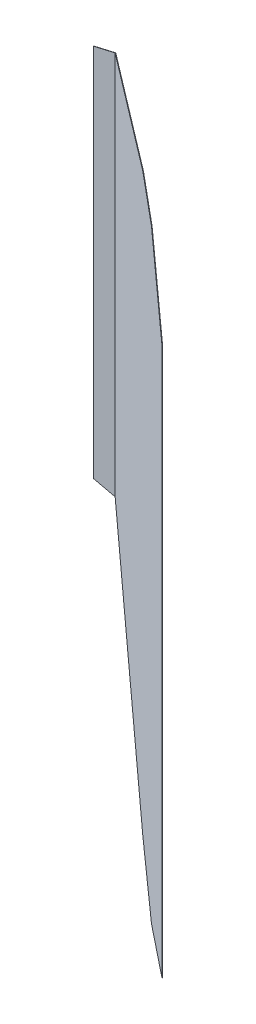
ISO-10303-21;
HEADER;
FILE_DESCRIPTION(('STEP AP214'),'2;1');
FILE_NAME('part.step','',(''),(''),'','','');
FILE_SCHEMA(('AUTOMOTIVE_DESIGN { 1 0 10303 214 1 1 1 1 }'));
ENDSEC;
DATA;
#1=APPLICATION_CONTEXT('core data for automotive mechanical design processes');
#2=APPLICATION_PROTOCOL_DEFINITION('international standard','automotive_design',2000,#1);
#3=PRODUCT_CONTEXT('',#1,'mechanical');
#4=PRODUCT('Part','Part','',(#3));
#5=PRODUCT_RELATED_PRODUCT_CATEGORY('part','',(#4));
#6=PRODUCT_DEFINITION_FORMATION('','',#4);
#7=PRODUCT_DEFINITION_CONTEXT('part definition',#1,'design');
#8=PRODUCT_DEFINITION('design','',#6,#7);
#9=PRODUCT_DEFINITION_SHAPE('','',#8);
#10=(LENGTH_UNIT() NAMED_UNIT(*) SI_UNIT(.MILLI.,.METRE.));
#11=(NAMED_UNIT(*) PLANE_ANGLE_UNIT() SI_UNIT($,.RADIAN.));
#12=(NAMED_UNIT(*) SI_UNIT($,.STERADIAN.) SOLID_ANGLE_UNIT());
#13=UNCERTAINTY_MEASURE_WITH_UNIT(LENGTH_MEASURE(1.E-05),#10,'distance_accuracy_value','');
#14=(GEOMETRIC_REPRESENTATION_CONTEXT(3) GLOBAL_UNCERTAINTY_ASSIGNED_CONTEXT((#13)) GLOBAL_UNIT_ASSIGNED_CONTEXT((#10,
#11,#12)) REPRESENTATION_CONTEXT('',''));
#15=CARTESIAN_POINT('',(0.,0.,0.));
#16=DIRECTION('',(0.,0.,1.));
#17=DIRECTION('',(1.,0.,0.));
#18=AXIS2_PLACEMENT_3D('',#15,#16,#17);
#19=CARTESIAN_POINT('',(961.046281695282,-400.,470.048059203297));
#20=DIRECTION('',(0.656059028990508,0.,-0.754709580222771));
#21=DIRECTION('',(-0.754709580222771,0.,-0.656059028990508));
#22=AXIS2_PLACEMENT_3D('',#19,#20,#21);
#23=PLANE('',#22);
#24=DIRECTION('',(0.,1.,0.));
#25=VECTOR('',#24,1.);
#26=CARTESIAN_POINT('',(543.39,-400.,106.98499255995));
#27=LINE('',#26,#25);
#28=CARTESIAN_POINT('',(543.39,-223.693412105865,106.98499255995));
#29=VERTEX_POINT('',#28);
#30=CARTESIAN_POINT('',(543.39,223.693412105865,106.98499255995));
#31=VERTEX_POINT('',#30);
#32=EDGE_CURVE('E193',#29,#31,#27,.T.);
#33=ORIENTED_EDGE('',*,*,#32,.T.);
#34=DIRECTION('',(0.714377011708552,0.322531231414625,0.620998462079033));
#35=VECTOR('',#34,1.);
#36=CARTESIAN_POINT('',(773.89449293756,327.762967446044,307.359491277625));
#37=LINE('',#36,#35);
#38=CARTESIAN_POINT('',(790.210009542547,335.12919504789,321.54235348296));
#39=VERTEX_POINT('',#38);
#40=EDGE_CURVE('E65',#31,#39,#37,.T.);
#41=ORIENTED_EDGE('',*,*,#40,.T.);
#42=DIRECTION('',(0.744983290834813,0.160027600780985,0.647604094617394));
#43=VECTOR('',#42,1.);
#44=CARTESIAN_POINT('',(869.030813607693,352.060452864477,390.060233120804));
#45=LINE('',#44,#43);
#46=CARTESIAN_POINT('',(867.278022463826,351.683941115994,388.536555025278));
#47=VERTEX_POINT('',#46);
#48=EDGE_CURVE('E166',#39,#47,#45,.T.);
#49=ORIENTED_EDGE('',*,*,#48,.T.);
#50=DIRECTION('',(0.729499819806553,-0.256302053123606,0.634144518597166));
#51=VECTOR('',#50,1.);
#52=CARTESIAN_POINT('',(1095.43065165295,271.524925720722,586.866609777288));
#53=LINE('',#52,#51);
#54=CARTESIAN_POINT('',(961.046281695282,318.739454076611,470.048059203297));
#55=VERTEX_POINT('',#54);
#56=EDGE_CURVE('E159',#47,#55,#53,.T.);
#57=ORIENTED_EDGE('',*,*,#56,.T.);
#58=DIRECTION('',(0.,1.,0.));
#59=VECTOR('',#58,1.);
#60=CARTESIAN_POINT('',(961.046281695282,-400.,470.048059203297));
#61=LINE('',#60,#59);
#62=CARTESIAN_POINT('',(961.046281695282,-318.739454076611,470.048059203297));
#63=VERTEX_POINT('',#62);
#64=EDGE_CURVE('E196',#63,#55,#61,.T.);
#65=ORIENTED_EDGE('',*,*,#64,.F.);
#66=DIRECTION('',(-0.729499819806553,-0.256302053123606,-0.634144518597166));
#67=VECTOR('',#66,1.);
#68=CARTESIAN_POINT('',(945.852810397173,-324.077519669023,456.84057610246));
#69=LINE('',#68,#67);
#70=CARTESIAN_POINT('',(867.278022463826,-351.683941115994,388.536555025278));
#71=VERTEX_POINT('',#70);
#72=EDGE_CURVE('E184',#63,#71,#69,.T.);
#73=ORIENTED_EDGE('',*,*,#72,.T.);
#74=DIRECTION('',(-0.744983290834813,0.160027600780985,-0.647604094617394));
#75=VECTOR('',#74,1.);
#76=CARTESIAN_POINT('',(964.405124531068,-372.547519273852,472.967856734855));
#77=LINE('',#76,#75);
#78=CARTESIAN_POINT('',(790.210009542546,-335.12919504789,321.54235348296));
#79=VERTEX_POINT('',#78);
#80=EDGE_CURVE('E190',#71,#79,#77,.T.);
#81=ORIENTED_EDGE('',*,*,#80,.T.);
#82=DIRECTION('',(-0.714377011708552,0.322531231414625,-0.620998462079033));
#83=VECTOR('',#82,1.);
#84=CARTESIAN_POINT('',(958.221610762087,-410.984083636311,467.592610222376));
#85=LINE('',#84,#83);
#86=EDGE_CURVE('E176',#79,#29,#85,.T.);
#87=ORIENTED_EDGE('',*,*,#86,.T.);
#88=EDGE_LOOP('',(#33,#41,#49,#57,#65,#73,#81,#87));
#89=FACE_BOUND('',#88,.T.);
#90=ADVANCED_FACE('F50',(#89),#23,.T.);
#91=CARTESIAN_POINT('',(960.718252180786,-400.,470.425413993408));
#92=DIRECTION('',(0.656059028990509,0.,-0.754709580222771));
#93=DIRECTION('',(-0.754709580222771,0.,-0.656059028990509));
#94=AXIS2_PLACEMENT_3D('',#91,#92,#93);
#95=PLANE('',#94);
#96=DIRECTION('',(0.714377011708552,0.322531231414625,0.620998462079034));
#97=VECTOR('',#96,1.);
#98=CARTESIAN_POINT('',(773.561643532495,327.781710188962,307.732656200787));
#99=LINE('',#98,#97);
#100=CARTESIAN_POINT('',(543.203057660258,223.778029848509,107.48499255995));
#101=VERTEX_POINT('',#100);
#102=CARTESIAN_POINT('',(789.793595119899,335.110209353888,321.842876444591));
#103=VERTEX_POINT('',#102);
#104=EDGE_CURVE('E151',#101,#103,#99,.T.);
#105=ORIENTED_EDGE('',*,*,#104,.F.);
#106=DIRECTION('',(0.,1.,0.));
#107=VECTOR('',#106,1.);
#108=CARTESIAN_POINT('',(543.203057660258,-400.,107.48499255995));
#109=LINE('',#108,#107);
#110=CARTESIAN_POINT('',(543.203057660258,-223.778029848509,107.48499255995));
#111=VERTEX_POINT('',#110);
#112=EDGE_CURVE('E135',#111,#101,#109,.T.);
#113=ORIENTED_EDGE('',*,*,#112,.F.);
#114=DIRECTION('',(-0.714377011708552,0.322531231414625,-0.620998462079034));
#115=VECTOR('',#114,1.);
#116=CARTESIAN_POINT('',(957.888761357023,-411.00282637923,467.965775145538));
#117=LINE('',#116,#115);
#118=CARTESIAN_POINT('',(789.793595119899,-335.110209353888,321.842876444591));
#119=VERTEX_POINT('',#118);
#120=EDGE_CURVE('E173',#119,#111,#117,.T.);
#121=ORIENTED_EDGE('',*,*,#120,.F.);
#122=DIRECTION('',(-0.744983290834813,0.160027600780985,-0.647604094617394));
#123=VECTOR('',#122,1.);
#124=CARTESIAN_POINT('',(964.077095016572,-372.547519273852,473.345211524966));
#125=LINE('',#124,#123);
#126=CARTESIAN_POINT('',(866.94999294933,-351.683941115994,388.913909815389));
#127=VERTEX_POINT('',#126);
#128=EDGE_CURVE('E187',#127,#119,#125,.T.);
#129=ORIENTED_EDGE('',*,*,#128,.F.);
#130=DIRECTION('',(-0.729499819806553,-0.256302053123606,-0.634144518597166));
#131=VECTOR('',#130,1.);
#132=CARTESIAN_POINT('',(945.524780882678,-324.077519669023,457.217930892571));
#133=LINE('',#132,#131);
#134=CARTESIAN_POINT('',(960.718252180786,-318.739454076611,470.425413993408));
#135=VERTEX_POINT('',#134);
#136=EDGE_CURVE('E180',#135,#127,#133,.T.);
#137=ORIENTED_EDGE('',*,*,#136,.F.);
#138=DIRECTION('',(0.,1.,0.));
#139=VECTOR('',#138,1.);
#140=CARTESIAN_POINT('',(960.718252180786,-400.,470.425413993408));
#141=LINE('',#140,#139);
#142=CARTESIAN_POINT('',(960.718252180786,318.739454076611,470.425413993408));
#143=VERTEX_POINT('',#142);
#144=EDGE_CURVE('E199',#135,#143,#141,.T.);
#145=ORIENTED_EDGE('',*,*,#144,.T.);
#146=DIRECTION('',(0.729499819806553,-0.256302053123606,0.634144518597166));
#147=VECTOR('',#146,1.);
#148=CARTESIAN_POINT('',(1095.10262213845,271.524925720722,587.243964567399));
#149=LINE('',#148,#147);
#150=CARTESIAN_POINT('',(866.94999294933,351.683941115994,388.913909815389));
#151=VERTEX_POINT('',#150);
#152=EDGE_CURVE('E157',#151,#143,#149,.T.);
#153=ORIENTED_EDGE('',*,*,#152,.F.);
#154=DIRECTION('',(0.744983290834813,0.160027600780985,0.647604094617394));
#155=VECTOR('',#154,1.);
#156=CARTESIAN_POINT('',(868.702784093198,352.060452864477,390.437587910915));
#157=LINE('',#156,#155);
#158=EDGE_CURVE('E164',#103,#151,#157,.T.);
#159=ORIENTED_EDGE('',*,*,#158,.F.);
#160=EDGE_LOOP('',(#105,#113,#121,#129,#137,#145,#153,#159));
#161=FACE_BOUND('',#160,.T.);
#162=ADVANCED_FACE('F215',(#161),#95,.F.);
#163=CARTESIAN_POINT('',(-24.3499444713819,199.016868000288,-21.1670837955339));
#164=DIRECTION('',(-0.120774363409475,0.987112540183885,-0.104987552380054));
#165=DIRECTION('',(0.992598097817529,0.121445527744015,0.));
#166=AXIS2_PLACEMENT_3D('',#163,#164,#165);
#167=PLANE('',#166);
#168=ORIENTED_EDGE('',*,*,#48,.F.);
#169=DIRECTION('',(-0.810329641289505,-0.0369455757872452,0.584808427502008));
#170=VECTOR('',#169,1.);
#171=CARTESIAN_POINT('',(413.672954851487,317.961640534326,593.286137283959));
#172=LINE('',#171,#170);
#173=EDGE_CURVE('E72',#39,#103,#172,.T.);
#174=ORIENTED_EDGE('',*,*,#173,.T.);
#175=ORIENTED_EDGE('',*,*,#158,.T.);
#176=DIRECTION('',(0.656059028990509,0.,-0.754709580222771));
#177=VECTOR('',#176,1.);
#178=CARTESIAN_POINT('',(686.367569112506,351.683941115994,596.650225096666));
#179=LINE('',#178,#177);
#180=EDGE_CURVE('E58',#151,#47,#179,.T.);
#181=ORIENTED_EDGE('',*,*,#180,.T.);
#182=EDGE_LOOP('',(#168,#174,#175,#181));
#183=FACE_BOUND('',#182,.T.);
#184=ADVANCED_FACE('F208',(#183),#167,.T.);
#185=CARTESIAN_POINT('',(543.39,-400.,106.98499255995));
#186=DIRECTION('',(0.,0.,-1.));
#187=DIRECTION('',(-1.,0.,0.));
#188=AXIS2_PLACEMENT_3D('',#185,#186,#187);
#189=PLANE('',#188);
#190=DIRECTION('',(0.,1.,0.));
#191=VECTOR('',#190,1.);
#192=CARTESIAN_POINT('',(517.88,-400.,106.98499255995));
#193=LINE('',#192,#191);
#194=CARTESIAN_POINT('',(517.88,-217.833449956203,106.98499255995));
#195=VERTEX_POINT('',#194);
#196=CARTESIAN_POINT('',(517.88,217.833449956203,106.98499255995));
#197=VERTEX_POINT('',#196);
#198=EDGE_CURVE('E136',#195,#197,#193,.T.);
#199=ORIENTED_EDGE('',*,*,#198,.T.);
#200=DIRECTION('',(0.974616389908166,0.223881425139231,0.));
#201=VECTOR('',#200,1.);
#202=CARTESIAN_POINT('',(407.301029066465,192.43209424397,106.98499255995));
#203=LINE('',#202,#201);
#204=EDGE_CURVE('E145',#197,#31,#203,.T.);
#205=ORIENTED_EDGE('',*,*,#204,.T.);
#206=ORIENTED_EDGE('',*,*,#32,.F.);
#207=DIRECTION('',(-0.974616389908166,0.223881425139231,0.));
#208=VECTOR('',#207,1.);
#209=CARTESIAN_POINT('',(581.859834135819,-232.530408261869,106.984992559949));
#210=LINE('',#209,#208);
#211=EDGE_CURVE('E170',#29,#195,#210,.T.);
#212=ORIENTED_EDGE('',*,*,#211,.T.);
#213=EDGE_LOOP('',(#199,#205,#206,#212));
#214=FACE_BOUND('',#213,.T.);
#215=ADVANCED_FACE('F52',(#214),#189,.T.);
#216=CARTESIAN_POINT('',(543.39,-400.,107.48499255995));
#217=DIRECTION('',(0.,0.,-1.));
#218=DIRECTION('',(-1.,0.,0.));
#219=AXIS2_PLACEMENT_3D('',#216,#217,#218);
#220=PLANE('',#219);
#221=DIRECTION('',(0.974616389908166,0.223881425139231,0.));
#222=VECTOR('',#221,1.);
#223=CARTESIAN_POINT('',(407.273195510607,192.553261239898,107.48499255995));
#224=LINE('',#223,#222);
#225=CARTESIAN_POINT('',(517.88,217.961010663766,107.48499255995));
#226=VERTEX_POINT('',#225);
#227=EDGE_CURVE('E140',#226,#101,#224,.T.);
#228=ORIENTED_EDGE('',*,*,#227,.F.);
#229=DIRECTION('',(0.,1.,0.));
#230=VECTOR('',#229,1.);
#231=CARTESIAN_POINT('',(517.88,-400.,107.48499255995));
#232=LINE('',#231,#230);
#233=CARTESIAN_POINT('',(517.88,-217.961010663766,107.48499255995));
#234=VERTEX_POINT('',#233);
#235=EDGE_CURVE('E127',#234,#226,#232,.T.);
#236=ORIENTED_EDGE('',*,*,#235,.F.);
#237=DIRECTION('',(-0.974616389908166,0.223881425139231,0.));
#238=VECTOR('',#237,1.);
#239=CARTESIAN_POINT('',(581.832000579962,-232.651575257796,107.484992559949));
#240=LINE('',#239,#238);
#241=EDGE_CURVE('E168',#111,#234,#240,.T.);
#242=ORIENTED_EDGE('',*,*,#241,.F.);
#243=ORIENTED_EDGE('',*,*,#112,.T.);
#244=EDGE_LOOP('',(#228,#236,#242,#243));
#245=FACE_BOUND('',#244,.T.);
#246=ADVANCED_FACE('F141',(#245),#220,.F.);
#247=CARTESIAN_POINT('',(517.88,-400.,107.48499255995));
#248=DIRECTION('',(1.,0.,0.));
#249=DIRECTION('',(0.,0.,-1.));
#250=AXIS2_PLACEMENT_3D('',#247,#248,#249);
#251=PLANE('',#250);
#252=DIRECTION('',(0.,0.247203369569301,0.968963618550038));
#253=VECTOR('',#252,1.);
#254=CARTESIAN_POINT('',(517.88,180.197718620314,-40.5358704668661));
#255=LINE('',#254,#253);
#256=EDGE_CURVE('E13',#197,#226,#255,.T.);
#257=ORIENTED_EDGE('',*,*,#256,.F.);
#258=ORIENTED_EDGE('',*,*,#198,.F.);
#259=DIRECTION('',(0.,0.247203369569301,-0.968963618550038));
#260=VECTOR('',#259,1.);
#261=CARTESIAN_POINT('',(517.88,-229.085323361447,151.08898672964));
#262=LINE('',#261,#260);
#263=EDGE_CURVE('E132',#234,#195,#262,.T.);
#264=ORIENTED_EDGE('',*,*,#263,.F.);
#265=ORIENTED_EDGE('',*,*,#235,.T.);
#266=EDGE_LOOP('',(#257,#258,#264,#265));
#267=FACE_BOUND('',#266,.T.);
#268=ADVANCED_FACE('F129',(#267),#251,.F.);
#269=CARTESIAN_POINT('',(961.046281695282,-400.,470.048059203297));
#270=DIRECTION('',(-0.754709580222718,0.,-0.65605902899057));
#271=DIRECTION('',(-0.65605902899057,0.,0.754709580222718));
#272=AXIS2_PLACEMENT_3D('',#269,#270,#271);
#273=PLANE('',#272);
#274=DIRECTION('',(0.65605902899057,0.,-0.754709580222718));
#275=VECTOR('',#274,1.);
#276=CARTESIAN_POINT('',(961.046281695292,318.739454076611,470.048059203285));
#277=LINE('',#276,#275);
#278=EDGE_CURVE('E162',#143,#55,#277,.T.);
#279=ORIENTED_EDGE('',*,*,#278,.F.);
#280=ORIENTED_EDGE('',*,*,#144,.F.);
#281=DIRECTION('',(-0.65605902899057,0.,0.754709580222718));
#282=VECTOR('',#281,1.);
#283=CARTESIAN_POINT('',(961.04628169528,-318.739454076611,470.048059203298));
#284=LINE('',#283,#282);
#285=EDGE_CURVE('E182',#63,#135,#284,.T.);
#286=ORIENTED_EDGE('',*,*,#285,.F.);
#287=ORIENTED_EDGE('',*,*,#64,.T.);
#288=EDGE_LOOP('',(#279,#280,#286,#287));
#289=FACE_BOUND('',#288,.T.);
#290=ADVANCED_FACE('F221',(#289),#273,.F.);
#291=CARTESIAN_POINT('',(-24.3499444713819,-199.016868000288,-21.1670837955339));
#292=DIRECTION('',(-0.120774363409475,-0.987112540183885,-0.104987552380054));
#293=DIRECTION('',(0.992598097817529,-0.121445527744015,0.));
#294=AXIS2_PLACEMENT_3D('',#291,#292,#293);
#295=PLANE('',#294);
#296=ORIENTED_EDGE('',*,*,#128,.T.);
#297=DIRECTION('',(0.810329641289505,-0.0369455757872452,-0.584808427502008));
#298=VECTOR('',#297,1.);
#299=CARTESIAN_POINT('',(413.672954851487,-317.961640534326,593.286137283959));
#300=LINE('',#299,#298);
#301=EDGE_CURVE('E178',#119,#79,#300,.T.);
#302=ORIENTED_EDGE('',*,*,#301,.T.);
#303=ORIENTED_EDGE('',*,*,#80,.F.);
#304=DIRECTION('',(-0.656059028990509,0.,0.754709580222771));
#305=VECTOR('',#304,1.);
#306=CARTESIAN_POINT('',(686.367569112506,-351.683941115994,596.650225096666));
#307=LINE('',#306,#305);
#308=EDGE_CURVE('E195',#71,#127,#307,.T.);
#309=ORIENTED_EDGE('',*,*,#308,.T.);
#310=EDGE_LOOP('',(#296,#302,#303,#309));
#311=FACE_BOUND('',#310,.T.);
#312=ADVANCED_FACE('F227',(#311),#295,.T.);
#313=CARTESIAN_POINT('',(110.843151094132,-553.888363866905,96.3544812238894));
#314=DIRECTION('',(0.193433614923151,-0.966596739889301,0.168149276100547));
#315=DIRECTION('',(0.980558377542775,0.196227592939121,0.));
#316=AXIS2_PLACEMENT_3D('',#313,#314,#315);
#317=PLANE('',#316);
#318=ORIENTED_EDGE('',*,*,#72,.F.);
#319=ORIENTED_EDGE('',*,*,#285,.T.);
#320=ORIENTED_EDGE('',*,*,#136,.T.);
#321=ORIENTED_EDGE('',*,*,#308,.F.);
#322=EDGE_LOOP('',(#318,#319,#320,#321));
#323=FACE_BOUND('',#322,.T.);
#324=ADVANCED_FACE('F265',(#323),#317,.T.);
#325=CARTESIAN_POINT('',(-14.7084032822511,-64.0296572140637,-16.3353367584321));
#326=DIRECTION('',(-0.217265952213146,-0.945817447178788,-0.241298285574338));
#327=DIRECTION('',(0.,0.247203369569301,-0.968963618550038));
#328=AXIS2_PLACEMENT_3D('',#325,#326,#327);
#329=PLANE('',#328);
#330=ORIENTED_EDGE('',*,*,#301,.F.);
#331=ORIENTED_EDGE('',*,*,#120,.T.);
#332=ORIENTED_EDGE('',*,*,#241,.T.);
#333=ORIENTED_EDGE('',*,*,#263,.T.);
#334=ORIENTED_EDGE('',*,*,#211,.F.);
#335=ORIENTED_EDGE('',*,*,#86,.F.);
#336=EDGE_LOOP('',(#330,#331,#332,#333,#334,#335));
#337=FACE_BOUND('',#336,.T.);
#338=ADVANCED_FACE('F230',(#337),#329,.T.);
#339=CARTESIAN_POINT('',(110.843151094132,553.888363866905,96.3544812238894));
#340=DIRECTION('',(0.193433614923151,0.966596739889301,0.168149276100547));
#341=DIRECTION('',(0.980558377542775,-0.196227592939121,0.));
#342=AXIS2_PLACEMENT_3D('',#339,#340,#341);
#343=PLANE('',#342);
#344=ORIENTED_EDGE('',*,*,#152,.T.);
#345=ORIENTED_EDGE('',*,*,#278,.T.);
#346=ORIENTED_EDGE('',*,*,#56,.F.);
#347=ORIENTED_EDGE('',*,*,#180,.F.);
#348=EDGE_LOOP('',(#344,#345,#346,#347));
#349=FACE_BOUND('',#348,.T.);
#350=ADVANCED_FACE('F212',(#349),#343,.T.);
#351=CARTESIAN_POINT('',(-14.7084032822511,64.0296572140637,-16.3353367584321));
#352=DIRECTION('',(-0.217265952213146,0.945817447178788,-0.241298285574338));
#353=DIRECTION('',(0.,-0.247203369569301,-0.968963618550038));
#354=AXIS2_PLACEMENT_3D('',#351,#352,#353);
#355=PLANE('',#354);
#356=ORIENTED_EDGE('',*,*,#173,.F.);
#357=ORIENTED_EDGE('',*,*,#40,.F.);
#358=ORIENTED_EDGE('',*,*,#204,.F.);
#359=ORIENTED_EDGE('',*,*,#256,.T.);
#360=ORIENTED_EDGE('',*,*,#227,.T.);
#361=ORIENTED_EDGE('',*,*,#104,.T.);
#362=EDGE_LOOP('',(#356,#357,#358,#359,#360,#361));
#363=FACE_BOUND('',#362,.T.);
#364=ADVANCED_FACE('F148',(#363),#355,.T.);
#365=CLOSED_SHELL('',(#90,#162,#184,#215,#246,#268,#290,#312,#324,#338,#350,#364));
#366=MANIFOLD_SOLID_BREP('B2',#365);
#367=ADVANCED_BREP_SHAPE_REPRESENTATION('',(#18,#366),#14);
#368=SHAPE_DEFINITION_REPRESENTATION(#9,#367);
ENDSEC;
END-ISO-10303-21;
